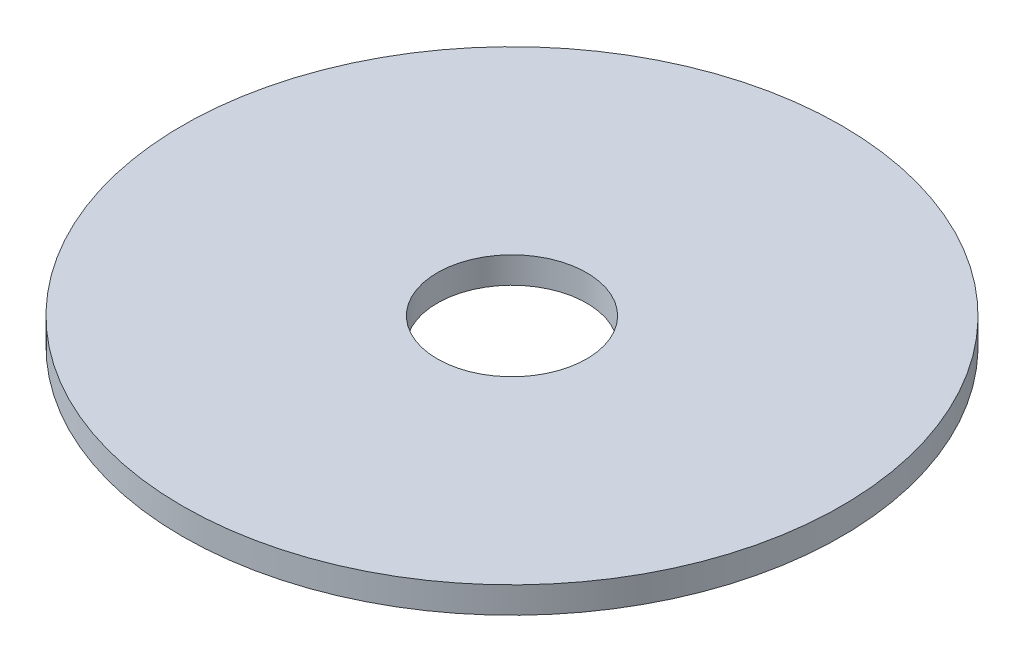
ISO-10303-21;
HEADER;
FILE_DESCRIPTION(('STEP AP214'),'2;1');
FILE_NAME('part.step','',(''),(''),'','','');
FILE_SCHEMA(('AUTOMOTIVE_DESIGN { 1 0 10303 214 1 1 1 1 }'));
ENDSEC;
DATA;
#1=APPLICATION_CONTEXT('core data for automotive mechanical design processes');
#2=APPLICATION_PROTOCOL_DEFINITION('international standard','automotive_design',2000,#1);
#3=PRODUCT_CONTEXT('',#1,'mechanical');
#4=PRODUCT('Part','Part','',(#3));
#5=PRODUCT_RELATED_PRODUCT_CATEGORY('part','',(#4));
#6=PRODUCT_DEFINITION_FORMATION('','',#4);
#7=PRODUCT_DEFINITION_CONTEXT('part definition',#1,'design');
#8=PRODUCT_DEFINITION('design','',#6,#7);
#9=PRODUCT_DEFINITION_SHAPE('','',#8);
#10=(LENGTH_UNIT() NAMED_UNIT(*) SI_UNIT(.MILLI.,.METRE.));
#11=(NAMED_UNIT(*) PLANE_ANGLE_UNIT() SI_UNIT($,.RADIAN.));
#12=(NAMED_UNIT(*) SI_UNIT($,.STERADIAN.) SOLID_ANGLE_UNIT());
#13=UNCERTAINTY_MEASURE_WITH_UNIT(LENGTH_MEASURE(1.E-05),#10,'distance_accuracy_value','');
#14=(GEOMETRIC_REPRESENTATION_CONTEXT(3) GLOBAL_UNCERTAINTY_ASSIGNED_CONTEXT((#13)) GLOBAL_UNIT_ASSIGNED_CONTEXT((#10,
#11,#12)) REPRESENTATION_CONTEXT('',''));
#15=CARTESIAN_POINT('',(0.,0.,0.));
#16=DIRECTION('',(0.,0.,1.));
#17=DIRECTION('',(1.,0.,0.));
#18=AXIS2_PLACEMENT_3D('',#15,#16,#17);
#19=CARTESIAN_POINT('',(0.,0.762,0.));
#20=DIRECTION('',(0.,1.,0.));
#21=DIRECTION('',(0.,0.,1.));
#22=AXIS2_PLACEMENT_3D('',#19,#20,#21);
#23=PLANE('',#22);
#24=CARTESIAN_POINT('',(0.,0.762,0.));
#25=DIRECTION('',(0.,1.,0.));
#26=DIRECTION('',(0.,0.,1.));
#27=AXIS2_PLACEMENT_3D('',#24,#25,#26);
#28=CIRCLE('',#27,9.525);
#29=CARTESIAN_POINT('',(0.,0.762,9.525));
#30=VERTEX_POINT('',#29);
#31=EDGE_CURVE('E10',#30,#30,#28,.T.);
#32=ORIENTED_EDGE('',*,*,#31,.T.);
#33=EDGE_LOOP('',(#32));
#34=FACE_BOUND('',#33,.T.);
#35=CARTESIAN_POINT('',(0.,0.762,0.));
#36=DIRECTION('',(0.,1.,0.));
#37=DIRECTION('',(0.,0.,1.));
#38=AXIS2_PLACEMENT_3D('',#35,#36,#37);
#39=CIRCLE('',#38,2.159);
#40=CARTESIAN_POINT('',(0.,0.762,2.159));
#41=VERTEX_POINT('',#40);
#42=EDGE_CURVE('E41',#41,#41,#39,.T.);
#43=ORIENTED_EDGE('',*,*,#42,.F.);
#44=EDGE_LOOP('',(#43));
#45=FACE_BOUND('',#44,.T.);
#46=ADVANCED_FACE('F30',(#34,#45),#23,.T.);
#47=CARTESIAN_POINT('',(0.,0.,0.));
#48=DIRECTION('',(0.,1.,0.));
#49=DIRECTION('',(0.,0.,1.));
#50=AXIS2_PLACEMENT_3D('',#47,#48,#49);
#51=PLANE('',#50);
#52=CARTESIAN_POINT('',(0.,0.,0.));
#53=DIRECTION('',(0.,1.,0.));
#54=DIRECTION('',(0.,0.,1.));
#55=AXIS2_PLACEMENT_3D('',#52,#53,#54);
#56=CIRCLE('',#55,9.525);
#57=CARTESIAN_POINT('',(0.,0.,9.525));
#58=VERTEX_POINT('',#57);
#59=EDGE_CURVE('E34',#58,#58,#56,.T.);
#60=ORIENTED_EDGE('',*,*,#59,.F.);
#61=EDGE_LOOP('',(#60));
#62=FACE_BOUND('',#61,.T.);
#63=CARTESIAN_POINT('',(0.,0.,0.));
#64=DIRECTION('',(0.,1.,0.));
#65=DIRECTION('',(0.,0.,1.));
#66=AXIS2_PLACEMENT_3D('',#63,#64,#65);
#67=CIRCLE('',#66,2.159);
#68=CARTESIAN_POINT('',(0.,0.,2.159));
#69=VERTEX_POINT('',#68);
#70=EDGE_CURVE('E43',#69,#69,#67,.T.);
#71=ORIENTED_EDGE('',*,*,#70,.T.);
#72=EDGE_LOOP('',(#71));
#73=FACE_BOUND('',#72,.T.);
#74=ADVANCED_FACE('F53',(#62,#73),#51,.F.);
#75=CARTESIAN_POINT('',(0.,0.762,0.));
#76=DIRECTION('',(0.,-1.,0.));
#77=DIRECTION('',(0.,0.,-1.));
#78=AXIS2_PLACEMENT_3D('',#75,#76,#77);
#79=CYLINDRICAL_SURFACE('',#78,9.525);
#80=ORIENTED_EDGE('',*,*,#31,.F.);
#81=EDGE_LOOP('',(#80));
#82=FACE_BOUND('',#81,.T.);
#83=ORIENTED_EDGE('',*,*,#59,.T.);
#84=EDGE_LOOP('',(#83));
#85=FACE_BOUND('',#84,.T.);
#86=ADVANCED_FACE('F32',(#82,#85),#79,.T.);
#87=CARTESIAN_POINT('',(0.,0.762,0.));
#88=DIRECTION('',(0.,-1.,0.));
#89=DIRECTION('',(0.,0.,-1.));
#90=AXIS2_PLACEMENT_3D('',#87,#88,#89);
#91=CYLINDRICAL_SURFACE('',#90,2.159);
#92=ORIENTED_EDGE('',*,*,#42,.T.);
#93=EDGE_LOOP('',(#92));
#94=FACE_BOUND('',#93,.T.);
#95=ORIENTED_EDGE('',*,*,#70,.F.);
#96=EDGE_LOOP('',(#95));
#97=FACE_BOUND('',#96,.T.);
#98=ADVANCED_FACE('F49',(#94,#97),#91,.F.);
#99=CLOSED_SHELL('',(#46,#74,#86,#98));
#100=MANIFOLD_SOLID_BREP('B2',#99);
#101=ADVANCED_BREP_SHAPE_REPRESENTATION('',(#18,#100),#14);
#102=SHAPE_DEFINITION_REPRESENTATION(#9,#101);
ENDSEC;
END-ISO-10303-21;
